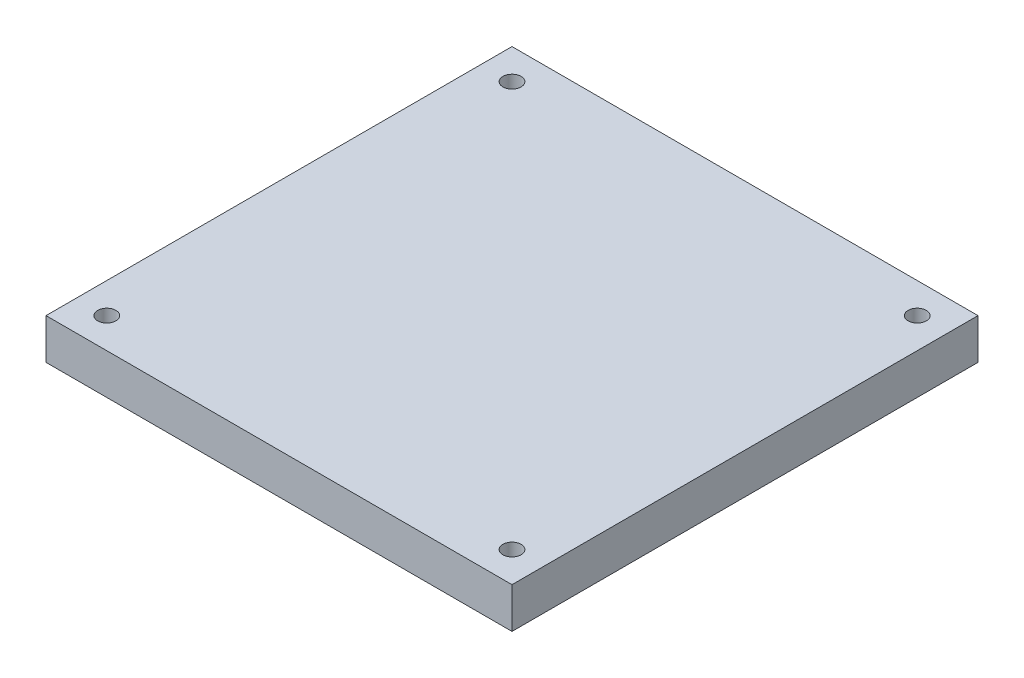
ISO-10303-21;
HEADER;
FILE_DESCRIPTION(('STEP AP214'),'2;1');
FILE_NAME('part.step','',(''),(''),'','','');
FILE_SCHEMA(('AUTOMOTIVE_DESIGN { 1 0 10303 214 1 1 1 1 }'));
ENDSEC;
DATA;
#1=APPLICATION_CONTEXT('core data for automotive mechanical design processes');
#2=APPLICATION_PROTOCOL_DEFINITION('international standard','automotive_design',2000,#1);
#3=PRODUCT_CONTEXT('',#1,'mechanical');
#4=PRODUCT('Part','Part','',(#3));
#5=PRODUCT_RELATED_PRODUCT_CATEGORY('part','',(#4));
#6=PRODUCT_DEFINITION_FORMATION('','',#4);
#7=PRODUCT_DEFINITION_CONTEXT('part definition',#1,'design');
#8=PRODUCT_DEFINITION('design','',#6,#7);
#9=PRODUCT_DEFINITION_SHAPE('','',#8);
#10=(LENGTH_UNIT() NAMED_UNIT(*) SI_UNIT(.MILLI.,.METRE.));
#11=(NAMED_UNIT(*) PLANE_ANGLE_UNIT() SI_UNIT($,.RADIAN.));
#12=(NAMED_UNIT(*) SI_UNIT($,.STERADIAN.) SOLID_ANGLE_UNIT());
#13=UNCERTAINTY_MEASURE_WITH_UNIT(LENGTH_MEASURE(1.E-05),#10,'distance_accuracy_value','');
#14=(GEOMETRIC_REPRESENTATION_CONTEXT(3) GLOBAL_UNCERTAINTY_ASSIGNED_CONTEXT((#13)) GLOBAL_UNIT_ASSIGNED_CONTEXT((#10,
#11,#12)) REPRESENTATION_CONTEXT('',''));
#15=CARTESIAN_POINT('',(0.,0.,0.));
#16=DIRECTION('',(0.,0.,1.));
#17=DIRECTION('',(1.,0.,0.));
#18=AXIS2_PLACEMENT_3D('',#15,#16,#17);
#19=CARTESIAN_POINT('',(0.,10.,0.));
#20=DIRECTION('',(0.,-1.,0.));
#21=DIRECTION('',(0.,0.,-1.));
#22=AXIS2_PLACEMENT_3D('',#19,#20,#21);
#23=PLANE('',#22);
#24=DIRECTION('',(0.,0.,1.));
#25=VECTOR('',#24,1.);
#26=CARTESIAN_POINT('',(0.,10.,0.));
#27=LINE('',#26,#25);
#28=CARTESIAN_POINT('',(0.,10.,-115.));
#29=VERTEX_POINT('',#28);
#30=CARTESIAN_POINT('',(0.,10.,0.));
#31=VERTEX_POINT('',#30);
#32=EDGE_CURVE('E94',#29,#31,#27,.T.);
#33=ORIENTED_EDGE('',*,*,#32,.T.);
#34=DIRECTION('',(1.,0.,0.));
#35=VECTOR('',#34,1.);
#36=CARTESIAN_POINT('',(0.,10.,0.));
#37=LINE('',#36,#35);
#38=CARTESIAN_POINT('',(115.,10.,0.));
#39=VERTEX_POINT('',#38);
#40=EDGE_CURVE('E89',#31,#39,#37,.T.);
#41=ORIENTED_EDGE('',*,*,#40,.T.);
#42=DIRECTION('',(0.,0.,-1.));
#43=VECTOR('',#42,1.);
#44=CARTESIAN_POINT('',(115.,10.,0.));
#45=LINE('',#44,#43);
#46=CARTESIAN_POINT('',(115.,10.,-115.));
#47=VERTEX_POINT('',#46);
#48=EDGE_CURVE('E92',#39,#47,#45,.T.);
#49=ORIENTED_EDGE('',*,*,#48,.T.);
#50=DIRECTION('',(-1.,0.,0.));
#51=VECTOR('',#50,1.);
#52=CARTESIAN_POINT('',(0.,10.,-115.));
#53=LINE('',#52,#51);
#54=EDGE_CURVE('E59',#47,#29,#53,.T.);
#55=ORIENTED_EDGE('',*,*,#54,.T.);
#56=EDGE_LOOP('',(#33,#41,#49,#55));
#57=FACE_BOUND('',#56,.T.);
#58=CARTESIAN_POINT('',(7.5,10.,-7.50000000000001));
#59=DIRECTION('',(0.,1.,0.));
#60=DIRECTION('',(0.,0.,1.));
#61=AXIS2_PLACEMENT_3D('',#58,#59,#60);
#62=CIRCLE('',#61,2.25);
#63=CARTESIAN_POINT('',(7.5,10.,-5.25000000000001));
#64=VERTEX_POINT('',#63);
#65=EDGE_CURVE('E109',#64,#64,#62,.T.);
#66=ORIENTED_EDGE('',*,*,#65,.F.);
#67=EDGE_LOOP('',(#66));
#68=FACE_BOUND('',#67,.T.);
#69=CARTESIAN_POINT('',(107.5,10.,-7.50000000000001));
#70=DIRECTION('',(0.,1.,0.));
#71=DIRECTION('',(0.,0.,1.));
#72=AXIS2_PLACEMENT_3D('',#69,#70,#71);
#73=CIRCLE('',#72,2.25);
#74=CARTESIAN_POINT('',(107.5,10.,-5.25000000000001));
#75=VERTEX_POINT('',#74);
#76=EDGE_CURVE('E124',#75,#75,#73,.T.);
#77=ORIENTED_EDGE('',*,*,#76,.F.);
#78=EDGE_LOOP('',(#77));
#79=FACE_BOUND('',#78,.T.);
#80=CARTESIAN_POINT('',(107.5,10.,-107.5));
#81=DIRECTION('',(0.,1.,0.));
#82=DIRECTION('',(0.,0.,1.));
#83=AXIS2_PLACEMENT_3D('',#80,#81,#82);
#84=CIRCLE('',#83,2.25);
#85=CARTESIAN_POINT('',(107.5,10.,-105.25));
#86=VERTEX_POINT('',#85);
#87=EDGE_CURVE('E130',#86,#86,#84,.T.);
#88=ORIENTED_EDGE('',*,*,#87,.F.);
#89=EDGE_LOOP('',(#88));
#90=FACE_BOUND('',#89,.T.);
#91=CARTESIAN_POINT('',(7.5,10.,-107.5));
#92=DIRECTION('',(0.,1.,0.));
#93=DIRECTION('',(0.,0.,1.));
#94=AXIS2_PLACEMENT_3D('',#91,#92,#93);
#95=CIRCLE('',#94,2.25);
#96=CARTESIAN_POINT('',(7.5,10.,-105.25));
#97=VERTEX_POINT('',#96);
#98=EDGE_CURVE('E136',#97,#97,#95,.T.);
#99=ORIENTED_EDGE('',*,*,#98,.F.);
#100=EDGE_LOOP('',(#99));
#101=FACE_BOUND('',#100,.T.);
#102=ADVANCED_FACE('F42',(#57,#68,#79,#90,#101),#23,.F.);
#103=CARTESIAN_POINT('',(0.,0.,0.));
#104=DIRECTION('',(0.,-1.,0.));
#105=DIRECTION('',(0.,0.,-1.));
#106=AXIS2_PLACEMENT_3D('',#103,#104,#105);
#107=PLANE('',#106);
#108=CARTESIAN_POINT('',(107.5,0.,-107.5));
#109=DIRECTION('',(0.,1.,0.));
#110=DIRECTION('',(0.,0.,1.));
#111=AXIS2_PLACEMENT_3D('',#108,#109,#110);
#112=CIRCLE('',#111,2.25);
#113=CARTESIAN_POINT('',(107.5,0.,-105.25));
#114=VERTEX_POINT('',#113);
#115=EDGE_CURVE('E133',#114,#114,#112,.T.);
#116=ORIENTED_EDGE('',*,*,#115,.T.);
#117=EDGE_LOOP('',(#116));
#118=FACE_BOUND('',#117,.T.);
#119=CARTESIAN_POINT('',(7.5,0.,-7.50000000000001));
#120=DIRECTION('',(0.,1.,0.));
#121=DIRECTION('',(0.,0.,1.));
#122=AXIS2_PLACEMENT_3D('',#119,#120,#121);
#123=CIRCLE('',#122,2.25);
#124=CARTESIAN_POINT('',(7.5,0.,-5.25000000000001));
#125=VERTEX_POINT('',#124);
#126=EDGE_CURVE('E121',#125,#125,#123,.T.);
#127=ORIENTED_EDGE('',*,*,#126,.T.);
#128=EDGE_LOOP('',(#127));
#129=FACE_BOUND('',#128,.T.);
#130=DIRECTION('',(0.,0.,1.));
#131=VECTOR('',#130,1.);
#132=CARTESIAN_POINT('',(0.,0.,0.));
#133=LINE('',#132,#131);
#134=CARTESIAN_POINT('',(0.,0.,-115.));
#135=VERTEX_POINT('',#134);
#136=CARTESIAN_POINT('',(0.,0.,0.));
#137=VERTEX_POINT('',#136);
#138=EDGE_CURVE('E106',#135,#137,#133,.T.);
#139=ORIENTED_EDGE('',*,*,#138,.F.);
#140=DIRECTION('',(-1.,0.,0.));
#141=VECTOR('',#140,1.);
#142=CARTESIAN_POINT('',(0.,0.,-115.));
#143=LINE('',#142,#141);
#144=CARTESIAN_POINT('',(115.,0.,-115.));
#145=VERTEX_POINT('',#144);
#146=EDGE_CURVE('E82',#145,#135,#143,.T.);
#147=ORIENTED_EDGE('',*,*,#146,.F.);
#148=DIRECTION('',(0.,0.,-1.));
#149=VECTOR('',#148,1.);
#150=CARTESIAN_POINT('',(115.,0.,0.));
#151=LINE('',#150,#149);
#152=CARTESIAN_POINT('',(115.,0.,0.));
#153=VERTEX_POINT('',#152);
#154=EDGE_CURVE('E76',#153,#145,#151,.T.);
#155=ORIENTED_EDGE('',*,*,#154,.F.);
#156=DIRECTION('',(1.,0.,0.));
#157=VECTOR('',#156,1.);
#158=CARTESIAN_POINT('',(0.,0.,0.));
#159=LINE('',#158,#157);
#160=EDGE_CURVE('E98',#137,#153,#159,.T.);
#161=ORIENTED_EDGE('',*,*,#160,.F.);
#162=EDGE_LOOP('',(#139,#147,#155,#161));
#163=FACE_BOUND('',#162,.T.);
#164=CARTESIAN_POINT('',(107.5,0.,-7.50000000000001));
#165=DIRECTION('',(0.,1.,0.));
#166=DIRECTION('',(0.,0.,1.));
#167=AXIS2_PLACEMENT_3D('',#164,#165,#166);
#168=CIRCLE('',#167,2.25);
#169=CARTESIAN_POINT('',(107.5,0.,-5.25000000000001));
#170=VERTEX_POINT('',#169);
#171=EDGE_CURVE('E127',#170,#170,#168,.T.);
#172=ORIENTED_EDGE('',*,*,#171,.T.);
#173=EDGE_LOOP('',(#172));
#174=FACE_BOUND('',#173,.T.);
#175=CARTESIAN_POINT('',(7.5,0.,-107.5));
#176=DIRECTION('',(0.,1.,0.));
#177=DIRECTION('',(0.,0.,1.));
#178=AXIS2_PLACEMENT_3D('',#175,#176,#177);
#179=CIRCLE('',#178,2.25);
#180=CARTESIAN_POINT('',(7.5,0.,-105.25));
#181=VERTEX_POINT('',#180);
#182=EDGE_CURVE('E139',#181,#181,#179,.T.);
#183=ORIENTED_EDGE('',*,*,#182,.T.);
#184=EDGE_LOOP('',(#183));
#185=FACE_BOUND('',#184,.T.);
#186=ADVANCED_FACE('F117',(#118,#129,#163,#174,#185),#107,.T.);
#187=CARTESIAN_POINT('',(0.,10.,0.));
#188=DIRECTION('',(1.,0.,0.));
#189=DIRECTION('',(0.,0.,-1.));
#190=AXIS2_PLACEMENT_3D('',#187,#188,#189);
#191=PLANE('',#190);
#192=ORIENTED_EDGE('',*,*,#138,.T.);
#193=DIRECTION('',(0.,-1.,0.));
#194=VECTOR('',#193,1.);
#195=CARTESIAN_POINT('',(0.,10.,0.));
#196=LINE('',#195,#194);
#197=EDGE_CURVE('E11',#31,#137,#196,.T.);
#198=ORIENTED_EDGE('',*,*,#197,.F.);
#199=ORIENTED_EDGE('',*,*,#32,.F.);
#200=DIRECTION('',(0.,-1.,0.));
#201=VECTOR('',#200,1.);
#202=CARTESIAN_POINT('',(0.,10.,-115.));
#203=LINE('',#202,#201);
#204=EDGE_CURVE('E102',#29,#135,#203,.T.);
#205=ORIENTED_EDGE('',*,*,#204,.T.);
#206=EDGE_LOOP('',(#192,#198,#199,#205));
#207=FACE_BOUND('',#206,.T.);
#208=ADVANCED_FACE('F44',(#207),#191,.F.);
#209=CARTESIAN_POINT('',(0.,10.,0.));
#210=DIRECTION('',(0.,0.,-1.));
#211=DIRECTION('',(-1.,0.,0.));
#212=AXIS2_PLACEMENT_3D('',#209,#210,#211);
#213=PLANE('',#212);
#214=ORIENTED_EDGE('',*,*,#160,.T.);
#215=DIRECTION('',(0.,-1.,0.));
#216=VECTOR('',#215,1.);
#217=CARTESIAN_POINT('',(115.,10.,0.));
#218=LINE('',#217,#216);
#219=EDGE_CURVE('E51',#39,#153,#218,.T.);
#220=ORIENTED_EDGE('',*,*,#219,.F.);
#221=ORIENTED_EDGE('',*,*,#40,.F.);
#222=ORIENTED_EDGE('',*,*,#197,.T.);
#223=EDGE_LOOP('',(#214,#220,#221,#222));
#224=FACE_BOUND('',#223,.T.);
#225=ADVANCED_FACE('F97',(#224),#213,.F.);
#226=CARTESIAN_POINT('',(115.,10.,0.));
#227=DIRECTION('',(-1.,0.,0.));
#228=DIRECTION('',(0.,0.,1.));
#229=AXIS2_PLACEMENT_3D('',#226,#227,#228);
#230=PLANE('',#229);
#231=ORIENTED_EDGE('',*,*,#154,.T.);
#232=DIRECTION('',(0.,-1.,0.));
#233=VECTOR('',#232,1.);
#234=CARTESIAN_POINT('',(115.,10.,-115.));
#235=LINE('',#234,#233);
#236=EDGE_CURVE('E99',#47,#145,#235,.T.);
#237=ORIENTED_EDGE('',*,*,#236,.F.);
#238=ORIENTED_EDGE('',*,*,#48,.F.);
#239=ORIENTED_EDGE('',*,*,#219,.T.);
#240=EDGE_LOOP('',(#231,#237,#238,#239));
#241=FACE_BOUND('',#240,.T.);
#242=ADVANCED_FACE('F100',(#241),#230,.F.);
#243=CARTESIAN_POINT('',(0.,10.,-115.));
#244=DIRECTION('',(0.,0.,1.));
#245=DIRECTION('',(1.,0.,0.));
#246=AXIS2_PLACEMENT_3D('',#243,#244,#245);
#247=PLANE('',#246);
#248=ORIENTED_EDGE('',*,*,#146,.T.);
#249=ORIENTED_EDGE('',*,*,#204,.F.);
#250=ORIENTED_EDGE('',*,*,#54,.F.);
#251=ORIENTED_EDGE('',*,*,#236,.T.);
#252=EDGE_LOOP('',(#248,#249,#250,#251));
#253=FACE_BOUND('',#252,.T.);
#254=ADVANCED_FACE('F114',(#253),#247,.F.);
#255=CARTESIAN_POINT('',(7.5,10.,-7.50000000000001));
#256=DIRECTION('',(0.,-1.,0.));
#257=DIRECTION('',(0.,0.,-1.));
#258=AXIS2_PLACEMENT_3D('',#255,#256,#257);
#259=CYLINDRICAL_SURFACE('',#258,2.25);
#260=ORIENTED_EDGE('',*,*,#65,.T.);
#261=EDGE_LOOP('',(#260));
#262=FACE_BOUND('',#261,.T.);
#263=ORIENTED_EDGE('',*,*,#126,.F.);
#264=EDGE_LOOP('',(#263));
#265=FACE_BOUND('',#264,.T.);
#266=ADVANCED_FACE('F156',(#262,#265),#259,.F.);
#267=CARTESIAN_POINT('',(107.5,10.,-7.50000000000001));
#268=DIRECTION('',(0.,-1.,0.));
#269=DIRECTION('',(0.,0.,-1.));
#270=AXIS2_PLACEMENT_3D('',#267,#268,#269);
#271=CYLINDRICAL_SURFACE('',#270,2.25);
#272=ORIENTED_EDGE('',*,*,#76,.T.);
#273=EDGE_LOOP('',(#272));
#274=FACE_BOUND('',#273,.T.);
#275=ORIENTED_EDGE('',*,*,#171,.F.);
#276=EDGE_LOOP('',(#275));
#277=FACE_BOUND('',#276,.T.);
#278=ADVANCED_FACE('F201',(#274,#277),#271,.F.);
#279=CARTESIAN_POINT('',(107.5,10.,-107.5));
#280=DIRECTION('',(0.,-1.,0.));
#281=DIRECTION('',(0.,0.,-1.));
#282=AXIS2_PLACEMENT_3D('',#279,#280,#281);
#283=CYLINDRICAL_SURFACE('',#282,2.25);
#284=ORIENTED_EDGE('',*,*,#87,.T.);
#285=EDGE_LOOP('',(#284));
#286=FACE_BOUND('',#285,.T.);
#287=ORIENTED_EDGE('',*,*,#115,.F.);
#288=EDGE_LOOP('',(#287));
#289=FACE_BOUND('',#288,.T.);
#290=ADVANCED_FACE('F209',(#286,#289),#283,.F.);
#291=CARTESIAN_POINT('',(7.5,10.,-107.5));
#292=DIRECTION('',(0.,-1.,0.));
#293=DIRECTION('',(0.,0.,-1.));
#294=AXIS2_PLACEMENT_3D('',#291,#292,#293);
#295=CYLINDRICAL_SURFACE('',#294,2.25);
#296=ORIENTED_EDGE('',*,*,#98,.T.);
#297=EDGE_LOOP('',(#296));
#298=FACE_BOUND('',#297,.T.);
#299=ORIENTED_EDGE('',*,*,#182,.F.);
#300=EDGE_LOOP('',(#299));
#301=FACE_BOUND('',#300,.T.);
#302=ADVANCED_FACE('F145',(#298,#301),#295,.F.);
#303=CLOSED_SHELL('',(#102,#186,#208,#225,#242,#254,#266,#278,#290,#302));
#304=MANIFOLD_SOLID_BREP('B2',#303);
#305=ADVANCED_BREP_SHAPE_REPRESENTATION('',(#18,#304),#14);
#306=SHAPE_DEFINITION_REPRESENTATION(#9,#305);
ENDSEC;
END-ISO-10303-21;
